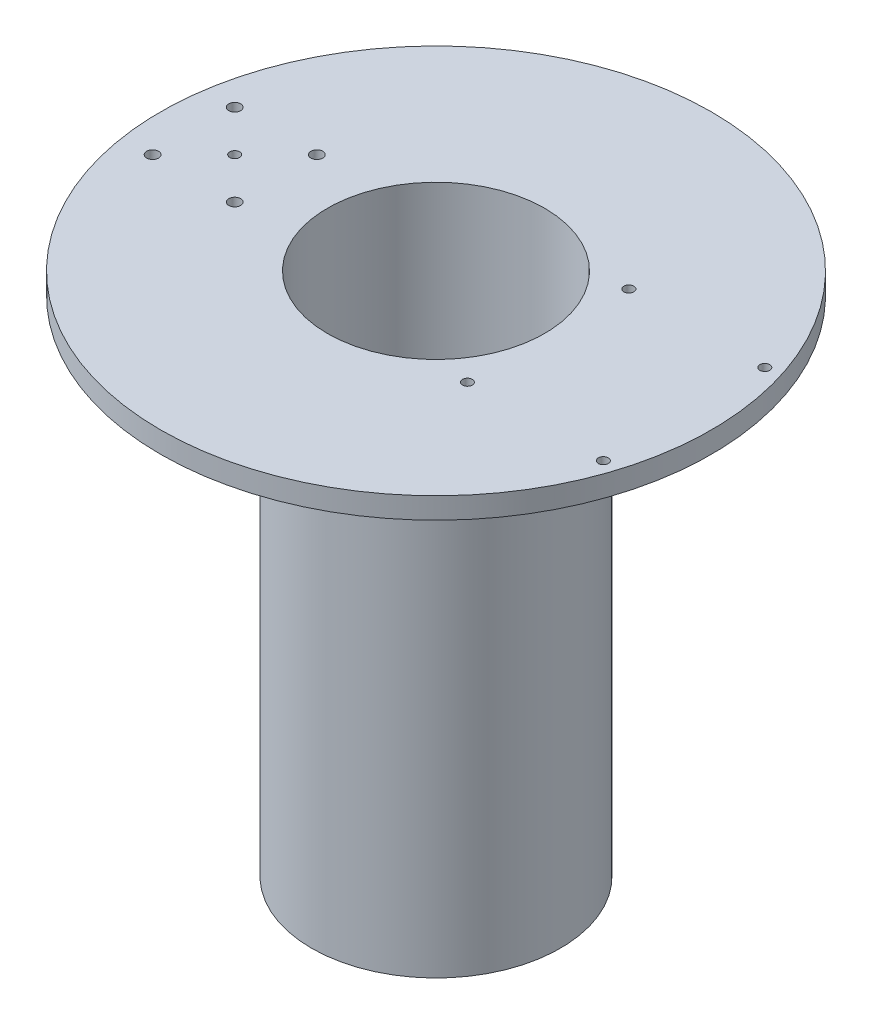
ISO-10303-21;
HEADER;
FILE_DESCRIPTION(('STEP AP214'),'2;1');
FILE_NAME('part.step','',(''),(''),'','','');
FILE_SCHEMA(('AUTOMOTIVE_DESIGN { 1 0 10303 214 1 1 1 1 }'));
ENDSEC;
DATA;
#1=APPLICATION_CONTEXT('core data for automotive mechanical design processes');
#2=APPLICATION_PROTOCOL_DEFINITION('international standard','automotive_design',2000,#1);
#3=PRODUCT_CONTEXT('',#1,'mechanical');
#4=PRODUCT('Part','Part','',(#3));
#5=PRODUCT_RELATED_PRODUCT_CATEGORY('part','',(#4));
#6=PRODUCT_DEFINITION_FORMATION('','',#4);
#7=PRODUCT_DEFINITION_CONTEXT('part definition',#1,'design');
#8=PRODUCT_DEFINITION('design','',#6,#7);
#9=PRODUCT_DEFINITION_SHAPE('','',#8);
#10=(LENGTH_UNIT() NAMED_UNIT(*) SI_UNIT(.MILLI.,.METRE.));
#11=(NAMED_UNIT(*) PLANE_ANGLE_UNIT() SI_UNIT($,.RADIAN.));
#12=(NAMED_UNIT(*) SI_UNIT($,.STERADIAN.) SOLID_ANGLE_UNIT());
#13=UNCERTAINTY_MEASURE_WITH_UNIT(LENGTH_MEASURE(1.E-05),#10,'distance_accuracy_value','');
#14=(GEOMETRIC_REPRESENTATION_CONTEXT(3) GLOBAL_UNCERTAINTY_ASSIGNED_CONTEXT((#13)) GLOBAL_UNIT_ASSIGNED_CONTEXT((#10,
#11,#12)) REPRESENTATION_CONTEXT('',''));
#15=CARTESIAN_POINT('',(0.,0.,0.));
#16=DIRECTION('',(0.,0.,1.));
#17=DIRECTION('',(1.,0.,0.));
#18=AXIS2_PLACEMENT_3D('',#15,#16,#17);
#19=CARTESIAN_POINT('',(104.,-190.,0.));
#20=DIRECTION('',(0.,-1.,0.));
#21=DIRECTION('',(0.,0.,-1.));
#22=AXIS2_PLACEMENT_3D('',#19,#20,#21);
#23=CYLINDRICAL_SURFACE('',#22,104.);
#24=CARTESIAN_POINT('',(104.,0.,0.));
#25=DIRECTION('',(0.,-1.,0.));
#26=DIRECTION('',(0.,0.,-1.));
#27=AXIS2_PLACEMENT_3D('',#24,#25,#26);
#28=CIRCLE('',#27,104.);
#29=CARTESIAN_POINT('',(104.,0.,-104.));
#30=VERTEX_POINT('',#29);
#31=EDGE_CURVE('E10',#30,#30,#28,.T.);
#32=ORIENTED_EDGE('',*,*,#31,.F.);
#33=EDGE_LOOP('',(#32));
#34=FACE_BOUND('',#33,.T.);
#35=CARTESIAN_POINT('',(104.,8.00000000000001,0.));
#36=DIRECTION('',(0.,-1.,0.));
#37=DIRECTION('',(0.,0.,-1.));
#38=AXIS2_PLACEMENT_3D('',#35,#36,#37);
#39=CIRCLE('',#38,104.);
#40=CARTESIAN_POINT('',(104.,8.00000000000001,-104.));
#41=VERTEX_POINT('',#40);
#42=EDGE_CURVE('E147',#41,#41,#39,.T.);
#43=ORIENTED_EDGE('',*,*,#42,.T.);
#44=EDGE_LOOP('',(#43));
#45=FACE_BOUND('',#44,.T.);
#46=ADVANCED_FACE('F39',(#34,#45),#23,.T.);
#47=CARTESIAN_POINT('',(0.,0.,0.));
#48=DIRECTION('',(0.,1.,0.));
#49=DIRECTION('',(0.,0.,1.));
#50=AXIS2_PLACEMENT_3D('',#47,#48,#49);
#51=PLANE('',#50);
#52=CARTESIAN_POINT('',(12.5,0.,-15.5));
#53=DIRECTION('',(0.,1.,0.));
#54=DIRECTION('',(0.,0.,1.));
#55=AXIS2_PLACEMENT_3D('',#52,#53,#54);
#56=CIRCLE('',#55,2.24999549999999);
#57=CARTESIAN_POINT('',(12.5,0.,-13.2500045));
#58=VERTEX_POINT('',#57);
#59=EDGE_CURVE('E96',#58,#58,#56,.T.);
#60=ORIENTED_EDGE('',*,*,#59,.T.);
#61=EDGE_LOOP('',(#60));
#62=FACE_BOUND('',#61,.T.);
#63=CARTESIAN_POINT('',(43.5,0.,-15.5));
#64=DIRECTION('',(0.,1.,0.));
#65=DIRECTION('',(0.,0.,1.));
#66=AXIS2_PLACEMENT_3D('',#63,#64,#65);
#67=CIRCLE('',#66,2.24999549999999);
#68=CARTESIAN_POINT('',(43.5,0.,-13.2500045));
#69=VERTEX_POINT('',#68);
#70=EDGE_CURVE('E102',#69,#69,#67,.T.);
#71=ORIENTED_EDGE('',*,*,#70,.T.);
#72=EDGE_LOOP('',(#71));
#73=FACE_BOUND('',#72,.T.);
#74=CARTESIAN_POINT('',(43.5,0.,15.5));
#75=DIRECTION('',(0.,1.,0.));
#76=DIRECTION('',(0.,0.,1.));
#77=AXIS2_PLACEMENT_3D('',#74,#75,#76);
#78=CIRCLE('',#77,2.24999549999999);
#79=CARTESIAN_POINT('',(43.5,0.,17.7499955));
#80=VERTEX_POINT('',#79);
#81=EDGE_CURVE('E108',#80,#80,#78,.T.);
#82=ORIENTED_EDGE('',*,*,#81,.T.);
#83=EDGE_LOOP('',(#82));
#84=FACE_BOUND('',#83,.T.);
#85=CARTESIAN_POINT('',(12.5,0.,15.5));
#86=DIRECTION('',(0.,1.,0.));
#87=DIRECTION('',(0.,0.,1.));
#88=AXIS2_PLACEMENT_3D('',#85,#86,#87);
#89=CIRCLE('',#88,2.24999549999999);
#90=CARTESIAN_POINT('',(12.5,0.,17.7499955));
#91=VERTEX_POINT('',#90);
#92=EDGE_CURVE('E114',#91,#91,#89,.T.);
#93=ORIENTED_EDGE('',*,*,#92,.T.);
#94=EDGE_LOOP('',(#93));
#95=FACE_BOUND('',#94,.T.);
#96=CARTESIAN_POINT('',(28.,0.,0.));
#97=DIRECTION('',(0.,1.,0.));
#98=DIRECTION('',(0.,0.,1.));
#99=AXIS2_PLACEMENT_3D('',#96,#97,#98);
#100=CIRCLE('',#99,1.87500005999998);
#101=CARTESIAN_POINT('',(28.,0.,1.87500005999998));
#102=VERTEX_POINT('',#101);
#103=EDGE_CURVE('E120',#102,#102,#100,.T.);
#104=ORIENTED_EDGE('',*,*,#103,.T.);
#105=EDGE_LOOP('',(#104));
#106=FACE_BOUND('',#105,.T.);
#107=CARTESIAN_POINT('',(146.346,0.,-30.48));
#108=DIRECTION('',(0.,1.,0.));
#109=DIRECTION('',(0.,0.,1.));
#110=AXIS2_PLACEMENT_3D('',#107,#108,#109);
#111=CIRCLE('',#110,1.87500005999998);
#112=CARTESIAN_POINT('',(146.346,0.,-28.60499994));
#113=VERTEX_POINT('',#112);
#114=EDGE_CURVE('E126',#113,#113,#111,.T.);
#115=ORIENTED_EDGE('',*,*,#114,.T.);
#116=EDGE_LOOP('',(#115));
#117=FACE_BOUND('',#116,.T.);
#118=CARTESIAN_POINT('',(197.654,0.,-30.48));
#119=DIRECTION('',(0.,1.,0.));
#120=DIRECTION('',(0.,0.,1.));
#121=AXIS2_PLACEMENT_3D('',#118,#119,#120);
#122=CIRCLE('',#121,1.87500005999998);
#123=CARTESIAN_POINT('',(197.654,0.,-28.60499994));
#124=VERTEX_POINT('',#123);
#125=EDGE_CURVE('E132',#124,#124,#122,.T.);
#126=ORIENTED_EDGE('',*,*,#125,.T.);
#127=EDGE_LOOP('',(#126));
#128=FACE_BOUND('',#127,.T.);
#129=CARTESIAN_POINT('',(197.654,0.,30.48));
#130=DIRECTION('',(0.,1.,0.));
#131=DIRECTION('',(0.,0.,1.));
#132=AXIS2_PLACEMENT_3D('',#129,#130,#131);
#133=CIRCLE('',#132,1.87500005999998);
#134=CARTESIAN_POINT('',(197.654,0.,32.35500006));
#135=VERTEX_POINT('',#134);
#136=EDGE_CURVE('E138',#135,#135,#133,.T.);
#137=ORIENTED_EDGE('',*,*,#136,.T.);
#138=EDGE_LOOP('',(#137));
#139=FACE_BOUND('',#138,.T.);
#140=CARTESIAN_POINT('',(146.346,0.,30.48));
#141=DIRECTION('',(0.,1.,0.));
#142=DIRECTION('',(0.,0.,1.));
#143=AXIS2_PLACEMENT_3D('',#140,#141,#142);
#144=CIRCLE('',#143,1.87500005999998);
#145=CARTESIAN_POINT('',(146.346,0.,32.35500006));
#146=VERTEX_POINT('',#145);
#147=EDGE_CURVE('E144',#146,#146,#144,.T.);
#148=ORIENTED_EDGE('',*,*,#147,.T.);
#149=EDGE_LOOP('',(#148));
#150=FACE_BOUND('',#149,.T.);
#151=CARTESIAN_POINT('',(104.,0.,0.));
#152=DIRECTION('',(0.,-1.,0.));
#153=DIRECTION('',(0.,0.,-1.));
#154=AXIS2_PLACEMENT_3D('',#151,#152,#153);
#155=CIRCLE('',#154,47.);
#156=CARTESIAN_POINT('',(104.,0.,-47.));
#157=VERTEX_POINT('',#156);
#158=EDGE_CURVE('E46',#157,#157,#155,.T.);
#159=ORIENTED_EDGE('',*,*,#158,.F.);
#160=EDGE_LOOP('',(#159));
#161=FACE_BOUND('',#160,.T.);
#162=ORIENTED_EDGE('',*,*,#31,.T.);
#163=EDGE_LOOP('',(#162));
#164=FACE_BOUND('',#163,.T.);
#165=ADVANCED_FACE('F163',(#62,#73,#84,#95,#106,#117,#128,#139,#150,#161,#164),#51,.F.);
#166=CARTESIAN_POINT('',(104.,-190.,0.));
#167=DIRECTION('',(0.,-1.,0.));
#168=DIRECTION('',(0.,0.,-1.));
#169=AXIS2_PLACEMENT_3D('',#166,#167,#168);
#170=CYLINDRICAL_SURFACE('',#169,47.);
#171=CARTESIAN_POINT('',(104.,-190.,0.));
#172=DIRECTION('',(0.,-1.,0.));
#173=DIRECTION('',(0.,0.,-1.));
#174=AXIS2_PLACEMENT_3D('',#171,#172,#173);
#175=CIRCLE('',#174,47.);
#176=CARTESIAN_POINT('',(104.,-190.,-47.));
#177=VERTEX_POINT('',#176);
#178=EDGE_CURVE('E51',#177,#177,#175,.T.);
#179=ORIENTED_EDGE('',*,*,#178,.F.);
#180=EDGE_LOOP('',(#179));
#181=FACE_BOUND('',#180,.T.);
#182=ORIENTED_EDGE('',*,*,#158,.T.);
#183=EDGE_LOOP('',(#182));
#184=FACE_BOUND('',#183,.T.);
#185=ADVANCED_FACE('F160',(#181,#184),#170,.T.);
#186=CARTESIAN_POINT('',(57.,-190.,0.));
#187=DIRECTION('',(0.,1.,0.));
#188=DIRECTION('',(0.,0.,1.));
#189=AXIS2_PLACEMENT_3D('',#186,#187,#188);
#190=PLANE('',#189);
#191=CARTESIAN_POINT('',(79.,-190.,25.));
#192=DIRECTION('',(0.,-1.,0.));
#193=DIRECTION('',(0.,0.,-1.));
#194=AXIS2_PLACEMENT_3D('',#191,#192,#193);
#195=CIRCLE('',#194,4.74999999999999);
#196=CARTESIAN_POINT('',(79.,-190.,20.25));
#197=VERTEX_POINT('',#196);
#198=EDGE_CURVE('E280',#197,#197,#195,.T.);
#199=ORIENTED_EDGE('',*,*,#198,.F.);
#200=EDGE_LOOP('',(#199));
#201=FACE_BOUND('',#200,.T.);
#202=CARTESIAN_POINT('',(79.,-190.,-25.));
#203=DIRECTION('',(0.,-1.,0.));
#204=DIRECTION('',(0.,0.,-1.));
#205=AXIS2_PLACEMENT_3D('',#202,#203,#204);
#206=CIRCLE('',#205,4.74999999999999);
#207=CARTESIAN_POINT('',(79.,-190.,-29.75));
#208=VERTEX_POINT('',#207);
#209=EDGE_CURVE('E79',#208,#208,#206,.T.);
#210=ORIENTED_EDGE('',*,*,#209,.F.);
#211=EDGE_LOOP('',(#210));
#212=FACE_BOUND('',#211,.T.);
#213=CARTESIAN_POINT('',(129.,-190.,-25.));
#214=DIRECTION('',(0.,-1.,0.));
#215=DIRECTION('',(0.,0.,-1.));
#216=AXIS2_PLACEMENT_3D('',#213,#214,#215);
#217=CIRCLE('',#216,4.75);
#218=CARTESIAN_POINT('',(129.,-190.,-29.75));
#219=VERTEX_POINT('',#218);
#220=EDGE_CURVE('E66',#219,#219,#217,.T.);
#221=ORIENTED_EDGE('',*,*,#220,.F.);
#222=EDGE_LOOP('',(#221));
#223=FACE_BOUND('',#222,.T.);
#224=CARTESIAN_POINT('',(129.,-190.,25.));
#225=DIRECTION('',(0.,-1.,0.));
#226=DIRECTION('',(0.,0.,-1.));
#227=AXIS2_PLACEMENT_3D('',#224,#225,#226);
#228=CIRCLE('',#227,4.75);
#229=CARTESIAN_POINT('',(129.,-190.,20.25));
#230=VERTEX_POINT('',#229);
#231=EDGE_CURVE('E62',#230,#230,#228,.T.);
#232=ORIENTED_EDGE('',*,*,#231,.F.);
#233=EDGE_LOOP('',(#232));
#234=FACE_BOUND('',#233,.T.);
#235=ORIENTED_EDGE('',*,*,#178,.T.);
#236=EDGE_LOOP('',(#235));
#237=FACE_BOUND('',#236,.T.);
#238=ADVANCED_FACE('F158',(#201,#212,#223,#234,#237),#190,.F.);
#239=CARTESIAN_POINT('',(104.,-185.,0.));
#240=DIRECTION('',(0.,-1.,0.));
#241=DIRECTION('',(0.,0.,-1.));
#242=AXIS2_PLACEMENT_3D('',#239,#240,#241);
#243=PLANE('',#242);
#244=CARTESIAN_POINT('',(79.,-185.,25.));
#245=DIRECTION('',(0.,-1.,0.));
#246=DIRECTION('',(0.,0.,-1.));
#247=AXIS2_PLACEMENT_3D('',#244,#245,#246);
#248=CIRCLE('',#247,2.74999999999997);
#249=CARTESIAN_POINT('',(79.,-185.,22.25));
#250=VERTEX_POINT('',#249);
#251=EDGE_CURVE('E42',#250,#250,#248,.T.);
#252=ORIENTED_EDGE('',*,*,#251,.T.);
#253=EDGE_LOOP('',(#252));
#254=FACE_BOUND('',#253,.T.);
#255=CARTESIAN_POINT('',(79.,-185.,-25.));
#256=DIRECTION('',(0.,-1.,0.));
#257=DIRECTION('',(0.,0.,-1.));
#258=AXIS2_PLACEMENT_3D('',#255,#256,#257);
#259=CIRCLE('',#258,2.74999999999997);
#260=CARTESIAN_POINT('',(79.,-185.,-27.75));
#261=VERTEX_POINT('',#260);
#262=EDGE_CURVE('E64',#261,#261,#259,.T.);
#263=ORIENTED_EDGE('',*,*,#262,.T.);
#264=EDGE_LOOP('',(#263));
#265=FACE_BOUND('',#264,.T.);
#266=CARTESIAN_POINT('',(129.,-185.,-25.));
#267=DIRECTION('',(0.,-1.,0.));
#268=DIRECTION('',(0.,0.,-1.));
#269=AXIS2_PLACEMENT_3D('',#266,#267,#268);
#270=CIRCLE('',#269,2.74999999999997);
#271=CARTESIAN_POINT('',(129.,-185.,-27.75));
#272=VERTEX_POINT('',#271);
#273=EDGE_CURVE('E60',#272,#272,#270,.T.);
#274=ORIENTED_EDGE('',*,*,#273,.T.);
#275=EDGE_LOOP('',(#274));
#276=FACE_BOUND('',#275,.T.);
#277=CARTESIAN_POINT('',(129.,-185.,25.));
#278=DIRECTION('',(0.,-1.,0.));
#279=DIRECTION('',(0.,0.,-1.));
#280=AXIS2_PLACEMENT_3D('',#277,#278,#279);
#281=CIRCLE('',#280,2.74999999999997);
#282=CARTESIAN_POINT('',(129.,-185.,22.25));
#283=VERTEX_POINT('',#282);
#284=EDGE_CURVE('E55',#283,#283,#281,.T.);
#285=ORIENTED_EDGE('',*,*,#284,.T.);
#286=EDGE_LOOP('',(#285));
#287=FACE_BOUND('',#286,.T.);
#288=CARTESIAN_POINT('',(104.,-185.,0.));
#289=DIRECTION('',(0.,-1.,0.));
#290=DIRECTION('',(0.,0.,-1.));
#291=AXIS2_PLACEMENT_3D('',#288,#289,#290);
#292=CIRCLE('',#291,41.);
#293=CARTESIAN_POINT('',(104.,-185.,-41.));
#294=VERTEX_POINT('',#293);
#295=EDGE_CURVE('E153',#294,#294,#292,.T.);
#296=ORIENTED_EDGE('',*,*,#295,.F.);
#297=EDGE_LOOP('',(#296));
#298=FACE_BOUND('',#297,.T.);
#299=ADVANCED_FACE('F177',(#254,#265,#276,#287,#298),#243,.F.);
#300=CARTESIAN_POINT('',(104.,-190.,0.));
#301=DIRECTION('',(0.,-1.,0.));
#302=DIRECTION('',(0.,0.,-1.));
#303=AXIS2_PLACEMENT_3D('',#300,#301,#302);
#304=CYLINDRICAL_SURFACE('',#303,41.);
#305=CARTESIAN_POINT('',(104.,8.00000000000001,0.));
#306=DIRECTION('',(0.,-1.,0.));
#307=DIRECTION('',(0.,0.,-1.));
#308=AXIS2_PLACEMENT_3D('',#305,#306,#307);
#309=CIRCLE('',#308,41.);
#310=CARTESIAN_POINT('',(104.,8.00000000000001,-41.));
#311=VERTEX_POINT('',#310);
#312=EDGE_CURVE('E150',#311,#311,#309,.T.);
#313=ORIENTED_EDGE('',*,*,#312,.F.);
#314=EDGE_LOOP('',(#313));
#315=FACE_BOUND('',#314,.T.);
#316=ORIENTED_EDGE('',*,*,#295,.T.);
#317=EDGE_LOOP('',(#316));
#318=FACE_BOUND('',#317,.T.);
#319=ADVANCED_FACE('F181',(#315,#318),#304,.F.);
#320=CARTESIAN_POINT('',(63.,8.,0.));
#321=DIRECTION('',(0.,-1.,0.));
#322=DIRECTION('',(0.,0.,-1.));
#323=AXIS2_PLACEMENT_3D('',#320,#321,#322);
#324=PLANE('',#323);
#325=CARTESIAN_POINT('',(12.5,8.,-15.5));
#326=DIRECTION('',(0.,1.,0.));
#327=DIRECTION('',(0.,0.,1.));
#328=AXIS2_PLACEMENT_3D('',#325,#326,#327);
#329=CIRCLE('',#328,2.2499955);
#330=CARTESIAN_POINT('',(12.5,8.,-13.2500045));
#331=VERTEX_POINT('',#330);
#332=EDGE_CURVE('E58',#331,#331,#329,.T.);
#333=ORIENTED_EDGE('',*,*,#332,.F.);
#334=EDGE_LOOP('',(#333));
#335=FACE_BOUND('',#334,.T.);
#336=CARTESIAN_POINT('',(43.5,8.,-15.5));
#337=DIRECTION('',(0.,1.,0.));
#338=DIRECTION('',(0.,0.,1.));
#339=AXIS2_PLACEMENT_3D('',#336,#337,#338);
#340=CIRCLE('',#339,2.2499955);
#341=CARTESIAN_POINT('',(43.5,8.,-13.2500045));
#342=VERTEX_POINT('',#341);
#343=EDGE_CURVE('E99',#342,#342,#340,.T.);
#344=ORIENTED_EDGE('',*,*,#343,.F.);
#345=EDGE_LOOP('',(#344));
#346=FACE_BOUND('',#345,.T.);
#347=CARTESIAN_POINT('',(43.5,8.,15.5));
#348=DIRECTION('',(0.,1.,0.));
#349=DIRECTION('',(0.,0.,1.));
#350=AXIS2_PLACEMENT_3D('',#347,#348,#349);
#351=CIRCLE('',#350,2.2499955);
#352=CARTESIAN_POINT('',(43.5,8.,17.7499955));
#353=VERTEX_POINT('',#352);
#354=EDGE_CURVE('E105',#353,#353,#351,.T.);
#355=ORIENTED_EDGE('',*,*,#354,.F.);
#356=EDGE_LOOP('',(#355));
#357=FACE_BOUND('',#356,.T.);
#358=CARTESIAN_POINT('',(12.5,8.,15.5));
#359=DIRECTION('',(0.,1.,0.));
#360=DIRECTION('',(0.,0.,1.));
#361=AXIS2_PLACEMENT_3D('',#358,#359,#360);
#362=CIRCLE('',#361,2.2499955);
#363=CARTESIAN_POINT('',(12.5,8.,17.7499955));
#364=VERTEX_POINT('',#363);
#365=EDGE_CURVE('E111',#364,#364,#362,.T.);
#366=ORIENTED_EDGE('',*,*,#365,.F.);
#367=EDGE_LOOP('',(#366));
#368=FACE_BOUND('',#367,.T.);
#369=CARTESIAN_POINT('',(28.,8.,0.));
#370=DIRECTION('',(0.,1.,0.));
#371=DIRECTION('',(0.,0.,1.));
#372=AXIS2_PLACEMENT_3D('',#369,#370,#371);
#373=CIRCLE('',#372,1.87500005999999);
#374=CARTESIAN_POINT('',(28.,8.,1.87500005999999));
#375=VERTEX_POINT('',#374);
#376=EDGE_CURVE('E117',#375,#375,#373,.T.);
#377=ORIENTED_EDGE('',*,*,#376,.F.);
#378=EDGE_LOOP('',(#377));
#379=FACE_BOUND('',#378,.T.);
#380=CARTESIAN_POINT('',(146.346,8.,-30.48));
#381=DIRECTION('',(0.,1.,0.));
#382=DIRECTION('',(0.,0.,1.));
#383=AXIS2_PLACEMENT_3D('',#380,#381,#382);
#384=CIRCLE('',#383,1.87500005999999);
#385=CARTESIAN_POINT('',(146.346,8.,-28.60499994));
#386=VERTEX_POINT('',#385);
#387=EDGE_CURVE('E123',#386,#386,#384,.T.);
#388=ORIENTED_EDGE('',*,*,#387,.F.);
#389=EDGE_LOOP('',(#388));
#390=FACE_BOUND('',#389,.T.);
#391=CARTESIAN_POINT('',(197.654,8.,-30.48));
#392=DIRECTION('',(0.,1.,0.));
#393=DIRECTION('',(0.,0.,1.));
#394=AXIS2_PLACEMENT_3D('',#391,#392,#393);
#395=CIRCLE('',#394,1.87500005999999);
#396=CARTESIAN_POINT('',(197.654,8.,-28.60499994));
#397=VERTEX_POINT('',#396);
#398=EDGE_CURVE('E129',#397,#397,#395,.T.);
#399=ORIENTED_EDGE('',*,*,#398,.F.);
#400=EDGE_LOOP('',(#399));
#401=FACE_BOUND('',#400,.T.);
#402=CARTESIAN_POINT('',(197.654,8.,30.48));
#403=DIRECTION('',(0.,1.,0.));
#404=DIRECTION('',(0.,0.,1.));
#405=AXIS2_PLACEMENT_3D('',#402,#403,#404);
#406=CIRCLE('',#405,1.87500005999999);
#407=CARTESIAN_POINT('',(197.654,8.,32.35500006));
#408=VERTEX_POINT('',#407);
#409=EDGE_CURVE('E135',#408,#408,#406,.T.);
#410=ORIENTED_EDGE('',*,*,#409,.F.);
#411=EDGE_LOOP('',(#410));
#412=FACE_BOUND('',#411,.T.);
#413=CARTESIAN_POINT('',(146.346,8.,30.48));
#414=DIRECTION('',(0.,1.,0.));
#415=DIRECTION('',(0.,0.,1.));
#416=AXIS2_PLACEMENT_3D('',#413,#414,#415);
#417=CIRCLE('',#416,1.87500005999999);
#418=CARTESIAN_POINT('',(146.346,8.,32.35500006));
#419=VERTEX_POINT('',#418);
#420=EDGE_CURVE('E141',#419,#419,#417,.T.);
#421=ORIENTED_EDGE('',*,*,#420,.F.);
#422=EDGE_LOOP('',(#421));
#423=FACE_BOUND('',#422,.T.);
#424=ORIENTED_EDGE('',*,*,#42,.F.);
#425=EDGE_LOOP('',(#424));
#426=FACE_BOUND('',#425,.T.);
#427=ORIENTED_EDGE('',*,*,#312,.T.);
#428=EDGE_LOOP('',(#427));
#429=FACE_BOUND('',#428,.T.);
#430=ADVANCED_FACE('F185',(#335,#346,#357,#368,#379,#390,#401,#412,#423,#426,#429),#324,.F.);
#431=CARTESIAN_POINT('',(146.346,8.,30.48));
#432=DIRECTION('',(0.,1.,0.));
#433=DIRECTION('',(0.,0.,1.));
#434=AXIS2_PLACEMENT_3D('',#431,#432,#433);
#435=CYLINDRICAL_SURFACE('',#434,1.87500005999998);
#436=ORIENTED_EDGE('',*,*,#420,.T.);
#437=EDGE_LOOP('',(#436));
#438=FACE_BOUND('',#437,.T.);
#439=ORIENTED_EDGE('',*,*,#147,.F.);
#440=EDGE_LOOP('',(#439));
#441=FACE_BOUND('',#440,.T.);
#442=ADVANCED_FACE('F189',(#438,#441),#435,.F.);
#443=CARTESIAN_POINT('',(197.654,8.,30.48));
#444=DIRECTION('',(0.,1.,0.));
#445=DIRECTION('',(0.,0.,1.));
#446=AXIS2_PLACEMENT_3D('',#443,#444,#445);
#447=CYLINDRICAL_SURFACE('',#446,1.87500005999998);
#448=ORIENTED_EDGE('',*,*,#409,.T.);
#449=EDGE_LOOP('',(#448));
#450=FACE_BOUND('',#449,.T.);
#451=ORIENTED_EDGE('',*,*,#136,.F.);
#452=EDGE_LOOP('',(#451));
#453=FACE_BOUND('',#452,.T.);
#454=ADVANCED_FACE('F193',(#450,#453),#447,.F.);
#455=CARTESIAN_POINT('',(197.654,8.,-30.48));
#456=DIRECTION('',(0.,1.,0.));
#457=DIRECTION('',(0.,0.,1.));
#458=AXIS2_PLACEMENT_3D('',#455,#456,#457);
#459=CYLINDRICAL_SURFACE('',#458,1.87500005999998);
#460=ORIENTED_EDGE('',*,*,#398,.T.);
#461=EDGE_LOOP('',(#460));
#462=FACE_BOUND('',#461,.T.);
#463=ORIENTED_EDGE('',*,*,#125,.F.);
#464=EDGE_LOOP('',(#463));
#465=FACE_BOUND('',#464,.T.);
#466=ADVANCED_FACE('F197',(#462,#465),#459,.F.);
#467=CARTESIAN_POINT('',(146.346,8.,-30.48));
#468=DIRECTION('',(0.,1.,0.));
#469=DIRECTION('',(0.,0.,1.));
#470=AXIS2_PLACEMENT_3D('',#467,#468,#469);
#471=CYLINDRICAL_SURFACE('',#470,1.87500005999998);
#472=ORIENTED_EDGE('',*,*,#387,.T.);
#473=EDGE_LOOP('',(#472));
#474=FACE_BOUND('',#473,.T.);
#475=ORIENTED_EDGE('',*,*,#114,.F.);
#476=EDGE_LOOP('',(#475));
#477=FACE_BOUND('',#476,.T.);
#478=ADVANCED_FACE('F201',(#474,#477),#471,.F.);
#479=CARTESIAN_POINT('',(28.,8.,0.));
#480=DIRECTION('',(0.,1.,0.));
#481=DIRECTION('',(0.,0.,1.));
#482=AXIS2_PLACEMENT_3D('',#479,#480,#481);
#483=CYLINDRICAL_SURFACE('',#482,1.87500005999998);
#484=ORIENTED_EDGE('',*,*,#376,.T.);
#485=EDGE_LOOP('',(#484));
#486=FACE_BOUND('',#485,.T.);
#487=ORIENTED_EDGE('',*,*,#103,.F.);
#488=EDGE_LOOP('',(#487));
#489=FACE_BOUND('',#488,.T.);
#490=ADVANCED_FACE('F205',(#486,#489),#483,.F.);
#491=CARTESIAN_POINT('',(12.5,8.,15.5));
#492=DIRECTION('',(0.,1.,0.));
#493=DIRECTION('',(0.,0.,1.));
#494=AXIS2_PLACEMENT_3D('',#491,#492,#493);
#495=CYLINDRICAL_SURFACE('',#494,2.24999549999999);
#496=ORIENTED_EDGE('',*,*,#365,.T.);
#497=EDGE_LOOP('',(#496));
#498=FACE_BOUND('',#497,.T.);
#499=ORIENTED_EDGE('',*,*,#92,.F.);
#500=EDGE_LOOP('',(#499));
#501=FACE_BOUND('',#500,.T.);
#502=ADVANCED_FACE('F209',(#498,#501),#495,.F.);
#503=CARTESIAN_POINT('',(43.5,8.,15.5));
#504=DIRECTION('',(0.,1.,0.));
#505=DIRECTION('',(0.,0.,1.));
#506=AXIS2_PLACEMENT_3D('',#503,#504,#505);
#507=CYLINDRICAL_SURFACE('',#506,2.24999549999999);
#508=ORIENTED_EDGE('',*,*,#354,.T.);
#509=EDGE_LOOP('',(#508));
#510=FACE_BOUND('',#509,.T.);
#511=ORIENTED_EDGE('',*,*,#81,.F.);
#512=EDGE_LOOP('',(#511));
#513=FACE_BOUND('',#512,.T.);
#514=ADVANCED_FACE('F213',(#510,#513),#507,.F.);
#515=CARTESIAN_POINT('',(43.5,8.,-15.5));
#516=DIRECTION('',(0.,1.,0.));
#517=DIRECTION('',(0.,0.,1.));
#518=AXIS2_PLACEMENT_3D('',#515,#516,#517);
#519=CYLINDRICAL_SURFACE('',#518,2.24999549999999);
#520=ORIENTED_EDGE('',*,*,#343,.T.);
#521=EDGE_LOOP('',(#520));
#522=FACE_BOUND('',#521,.T.);
#523=ORIENTED_EDGE('',*,*,#70,.F.);
#524=EDGE_LOOP('',(#523));
#525=FACE_BOUND('',#524,.T.);
#526=ADVANCED_FACE('F217',(#522,#525),#519,.F.);
#527=CARTESIAN_POINT('',(12.5,8.,-15.5));
#528=DIRECTION('',(0.,1.,0.));
#529=DIRECTION('',(0.,0.,1.));
#530=AXIS2_PLACEMENT_3D('',#527,#528,#529);
#531=CYLINDRICAL_SURFACE('',#530,2.24999549999999);
#532=ORIENTED_EDGE('',*,*,#332,.T.);
#533=EDGE_LOOP('',(#532));
#534=FACE_BOUND('',#533,.T.);
#535=ORIENTED_EDGE('',*,*,#59,.F.);
#536=EDGE_LOOP('',(#535));
#537=FACE_BOUND('',#536,.T.);
#538=ADVANCED_FACE('F221',(#534,#537),#531,.F.);
#539=CARTESIAN_POINT('',(129.,-190.,25.));
#540=DIRECTION('',(0.,-1.,0.));
#541=DIRECTION('',(0.,0.,-1.));
#542=AXIS2_PLACEMENT_3D('',#539,#540,#541);
#543=CYLINDRICAL_SURFACE('',#542,2.74999999999997);
#544=CARTESIAN_POINT('',(129.,-186.7,25.));
#545=DIRECTION('',(0.,-1.,0.));
#546=DIRECTION('',(0.,0.,-1.));
#547=AXIS2_PLACEMENT_3D('',#544,#545,#546);
#548=CIRCLE('',#547,2.75);
#549=CARTESIAN_POINT('',(129.,-186.7,22.25));
#550=VERTEX_POINT('',#549);
#551=EDGE_CURVE('E59',#550,#550,#548,.T.);
#552=ORIENTED_EDGE('',*,*,#551,.T.);
#553=EDGE_LOOP('',(#552));
#554=FACE_BOUND('',#553,.T.);
#555=ORIENTED_EDGE('',*,*,#284,.F.);
#556=EDGE_LOOP('',(#555));
#557=FACE_BOUND('',#556,.T.);
#558=ADVANCED_FACE('F225',(#554,#557),#543,.F.);
#559=CARTESIAN_POINT('',(131.75,-186.7,25.));
#560=DIRECTION('',(0.,1.,0.));
#561=DIRECTION('',(0.,0.,1.));
#562=AXIS2_PLACEMENT_3D('',#559,#560,#561);
#563=PLANE('',#562);
#564=ORIENTED_EDGE('',*,*,#551,.F.);
#565=EDGE_LOOP('',(#564));
#566=FACE_BOUND('',#565,.T.);
#567=CARTESIAN_POINT('',(129.,-186.7,25.));
#568=DIRECTION('',(0.,-1.,0.));
#569=DIRECTION('',(0.,0.,-1.));
#570=AXIS2_PLACEMENT_3D('',#567,#568,#569);
#571=CIRCLE('',#570,4.75);
#572=CARTESIAN_POINT('',(129.,-186.7,20.25));
#573=VERTEX_POINT('',#572);
#574=EDGE_CURVE('E89',#573,#573,#571,.T.);
#575=ORIENTED_EDGE('',*,*,#574,.T.);
#576=EDGE_LOOP('',(#575));
#577=FACE_BOUND('',#576,.T.);
#578=ADVANCED_FACE('F229',(#566,#577),#563,.F.);
#579=CARTESIAN_POINT('',(129.,-190.,25.));
#580=DIRECTION('',(0.,-1.,0.));
#581=DIRECTION('',(0.,0.,-1.));
#582=AXIS2_PLACEMENT_3D('',#579,#580,#581);
#583=CYLINDRICAL_SURFACE('',#582,4.75);
#584=ORIENTED_EDGE('',*,*,#574,.F.);
#585=EDGE_LOOP('',(#584));
#586=FACE_BOUND('',#585,.T.);
#587=ORIENTED_EDGE('',*,*,#231,.T.);
#588=EDGE_LOOP('',(#587));
#589=FACE_BOUND('',#588,.T.);
#590=ADVANCED_FACE('F233',(#586,#589),#583,.F.);
#591=CARTESIAN_POINT('',(129.,-190.,-25.));
#592=DIRECTION('',(0.,-1.,0.));
#593=DIRECTION('',(0.,0.,-1.));
#594=AXIS2_PLACEMENT_3D('',#591,#592,#593);
#595=CYLINDRICAL_SURFACE('',#594,2.74999999999997);
#596=CARTESIAN_POINT('',(129.,-186.7,-25.));
#597=DIRECTION('',(0.,-1.,0.));
#598=DIRECTION('',(0.,0.,-1.));
#599=AXIS2_PLACEMENT_3D('',#596,#597,#598);
#600=CIRCLE('',#599,2.75);
#601=CARTESIAN_POINT('',(129.,-186.7,-27.75));
#602=VERTEX_POINT('',#601);
#603=EDGE_CURVE('E63',#602,#602,#600,.T.);
#604=ORIENTED_EDGE('',*,*,#603,.T.);
#605=EDGE_LOOP('',(#604));
#606=FACE_BOUND('',#605,.T.);
#607=ORIENTED_EDGE('',*,*,#273,.F.);
#608=EDGE_LOOP('',(#607));
#609=FACE_BOUND('',#608,.T.);
#610=ADVANCED_FACE('F237',(#606,#609),#595,.F.);
#611=CARTESIAN_POINT('',(131.75,-186.7,-25.));
#612=DIRECTION('',(0.,1.,0.));
#613=DIRECTION('',(0.,0.,1.));
#614=AXIS2_PLACEMENT_3D('',#611,#612,#613);
#615=PLANE('',#614);
#616=ORIENTED_EDGE('',*,*,#603,.F.);
#617=EDGE_LOOP('',(#616));
#618=FACE_BOUND('',#617,.T.);
#619=CARTESIAN_POINT('',(129.,-186.7,-25.));
#620=DIRECTION('',(0.,-1.,0.));
#621=DIRECTION('',(0.,0.,-1.));
#622=AXIS2_PLACEMENT_3D('',#619,#620,#621);
#623=CIRCLE('',#622,4.75);
#624=CARTESIAN_POINT('',(129.,-186.7,-29.75));
#625=VERTEX_POINT('',#624);
#626=EDGE_CURVE('E71',#625,#625,#623,.T.);
#627=ORIENTED_EDGE('',*,*,#626,.T.);
#628=EDGE_LOOP('',(#627));
#629=FACE_BOUND('',#628,.T.);
#630=ADVANCED_FACE('F241',(#618,#629),#615,.F.);
#631=CARTESIAN_POINT('',(129.,-190.,-25.));
#632=DIRECTION('',(0.,-1.,0.));
#633=DIRECTION('',(0.,0.,-1.));
#634=AXIS2_PLACEMENT_3D('',#631,#632,#633);
#635=CYLINDRICAL_SURFACE('',#634,4.75);
#636=ORIENTED_EDGE('',*,*,#626,.F.);
#637=EDGE_LOOP('',(#636));
#638=FACE_BOUND('',#637,.T.);
#639=ORIENTED_EDGE('',*,*,#220,.T.);
#640=EDGE_LOOP('',(#639));
#641=FACE_BOUND('',#640,.T.);
#642=ADVANCED_FACE('F245',(#638,#641),#635,.F.);
#643=CARTESIAN_POINT('',(79.,-190.,-25.));
#644=DIRECTION('',(0.,-1.,0.));
#645=DIRECTION('',(0.,0.,-1.));
#646=AXIS2_PLACEMENT_3D('',#643,#644,#645);
#647=CYLINDRICAL_SURFACE('',#646,2.74999999999997);
#648=CARTESIAN_POINT('',(79.,-186.7,-25.));
#649=DIRECTION('',(0.,-1.,0.));
#650=DIRECTION('',(0.,0.,-1.));
#651=AXIS2_PLACEMENT_3D('',#648,#649,#650);
#652=CIRCLE('',#651,2.75);
#653=CARTESIAN_POINT('',(79.,-186.7,-27.75));
#654=VERTEX_POINT('',#653);
#655=EDGE_CURVE('E67',#654,#654,#652,.T.);
#656=ORIENTED_EDGE('',*,*,#655,.T.);
#657=EDGE_LOOP('',(#656));
#658=FACE_BOUND('',#657,.T.);
#659=ORIENTED_EDGE('',*,*,#262,.F.);
#660=EDGE_LOOP('',(#659));
#661=FACE_BOUND('',#660,.T.);
#662=ADVANCED_FACE('F249',(#658,#661),#647,.F.);
#663=CARTESIAN_POINT('',(81.75,-186.7,-25.));
#664=DIRECTION('',(0.,1.,0.));
#665=DIRECTION('',(0.,0.,1.));
#666=AXIS2_PLACEMENT_3D('',#663,#664,#665);
#667=PLANE('',#666);
#668=ORIENTED_EDGE('',*,*,#655,.F.);
#669=EDGE_LOOP('',(#668));
#670=FACE_BOUND('',#669,.T.);
#671=CARTESIAN_POINT('',(79.,-186.7,-25.));
#672=DIRECTION('',(0.,-1.,0.));
#673=DIRECTION('',(0.,0.,-1.));
#674=AXIS2_PLACEMENT_3D('',#671,#672,#673);
#675=CIRCLE('',#674,4.74999999999999);
#676=CARTESIAN_POINT('',(79.,-186.7,-29.75));
#677=VERTEX_POINT('',#676);
#678=EDGE_CURVE('E74',#677,#677,#675,.T.);
#679=ORIENTED_EDGE('',*,*,#678,.T.);
#680=EDGE_LOOP('',(#679));
#681=FACE_BOUND('',#680,.T.);
#682=ADVANCED_FACE('F253',(#670,#681),#667,.F.);
#683=CARTESIAN_POINT('',(79.,-190.,-25.));
#684=DIRECTION('',(0.,-1.,0.));
#685=DIRECTION('',(0.,0.,-1.));
#686=AXIS2_PLACEMENT_3D('',#683,#684,#685);
#687=CYLINDRICAL_SURFACE('',#686,4.74999999999999);
#688=ORIENTED_EDGE('',*,*,#678,.F.);
#689=EDGE_LOOP('',(#688));
#690=FACE_BOUND('',#689,.T.);
#691=ORIENTED_EDGE('',*,*,#209,.T.);
#692=EDGE_LOOP('',(#691));
#693=FACE_BOUND('',#692,.T.);
#694=ADVANCED_FACE('F256',(#690,#693),#687,.F.);
#695=CARTESIAN_POINT('',(79.,-190.,25.));
#696=DIRECTION('',(0.,-1.,0.));
#697=DIRECTION('',(0.,0.,-1.));
#698=AXIS2_PLACEMENT_3D('',#695,#696,#697);
#699=CYLINDRICAL_SURFACE('',#698,2.74999999999997);
#700=CARTESIAN_POINT('',(79.,-186.7,25.));
#701=DIRECTION('',(0.,-1.,0.));
#702=DIRECTION('',(0.,0.,-1.));
#703=AXIS2_PLACEMENT_3D('',#700,#701,#702);
#704=CIRCLE('',#703,2.75);
#705=CARTESIAN_POINT('',(79.,-186.7,22.25));
#706=VERTEX_POINT('',#705);
#707=EDGE_CURVE('E282',#706,#706,#704,.T.);
#708=ORIENTED_EDGE('',*,*,#707,.T.);
#709=EDGE_LOOP('',(#708));
#710=FACE_BOUND('',#709,.T.);
#711=ORIENTED_EDGE('',*,*,#251,.F.);
#712=EDGE_LOOP('',(#711));
#713=FACE_BOUND('',#712,.T.);
#714=ADVANCED_FACE('F260',(#710,#713),#699,.F.);
#715=CARTESIAN_POINT('',(81.75,-186.7,25.));
#716=DIRECTION('',(0.,1.,0.));
#717=DIRECTION('',(0.,0.,1.));
#718=AXIS2_PLACEMENT_3D('',#715,#716,#717);
#719=PLANE('',#718);
#720=ORIENTED_EDGE('',*,*,#707,.F.);
#721=EDGE_LOOP('',(#720));
#722=FACE_BOUND('',#721,.T.);
#723=CARTESIAN_POINT('',(79.,-186.7,25.));
#724=DIRECTION('',(0.,-1.,0.));
#725=DIRECTION('',(0.,0.,-1.));
#726=AXIS2_PLACEMENT_3D('',#723,#724,#725);
#727=CIRCLE('',#726,4.74999999999999);
#728=CARTESIAN_POINT('',(79.,-186.7,20.25));
#729=VERTEX_POINT('',#728);
#730=EDGE_CURVE('E277',#729,#729,#727,.T.);
#731=ORIENTED_EDGE('',*,*,#730,.T.);
#732=EDGE_LOOP('',(#731));
#733=FACE_BOUND('',#732,.T.);
#734=ADVANCED_FACE('F264',(#722,#733),#719,.F.);
#735=CARTESIAN_POINT('',(79.,-190.,25.));
#736=DIRECTION('',(0.,-1.,0.));
#737=DIRECTION('',(0.,0.,-1.));
#738=AXIS2_PLACEMENT_3D('',#735,#736,#737);
#739=CYLINDRICAL_SURFACE('',#738,4.74999999999999);
#740=ORIENTED_EDGE('',*,*,#730,.F.);
#741=EDGE_LOOP('',(#740));
#742=FACE_BOUND('',#741,.T.);
#743=ORIENTED_EDGE('',*,*,#198,.T.);
#744=EDGE_LOOP('',(#743));
#745=FACE_BOUND('',#744,.T.);
#746=ADVANCED_FACE('F268',(#742,#745),#739,.F.);
#747=CLOSED_SHELL('',(#46,#165,#185,#238,#299,#319,#430,#442,#454,#466,#478,#490,#502,#514,#526,
#538,#558,#578,#590,#610,#630,#642,#662,#682,#694,#714,#734,#746));
#748=MANIFOLD_SOLID_BREP('B2',#747);
#749=ADVANCED_BREP_SHAPE_REPRESENTATION('',(#18,#748),#14);
#750=SHAPE_DEFINITION_REPRESENTATION(#9,#749);
ENDSEC;
END-ISO-10303-21;
